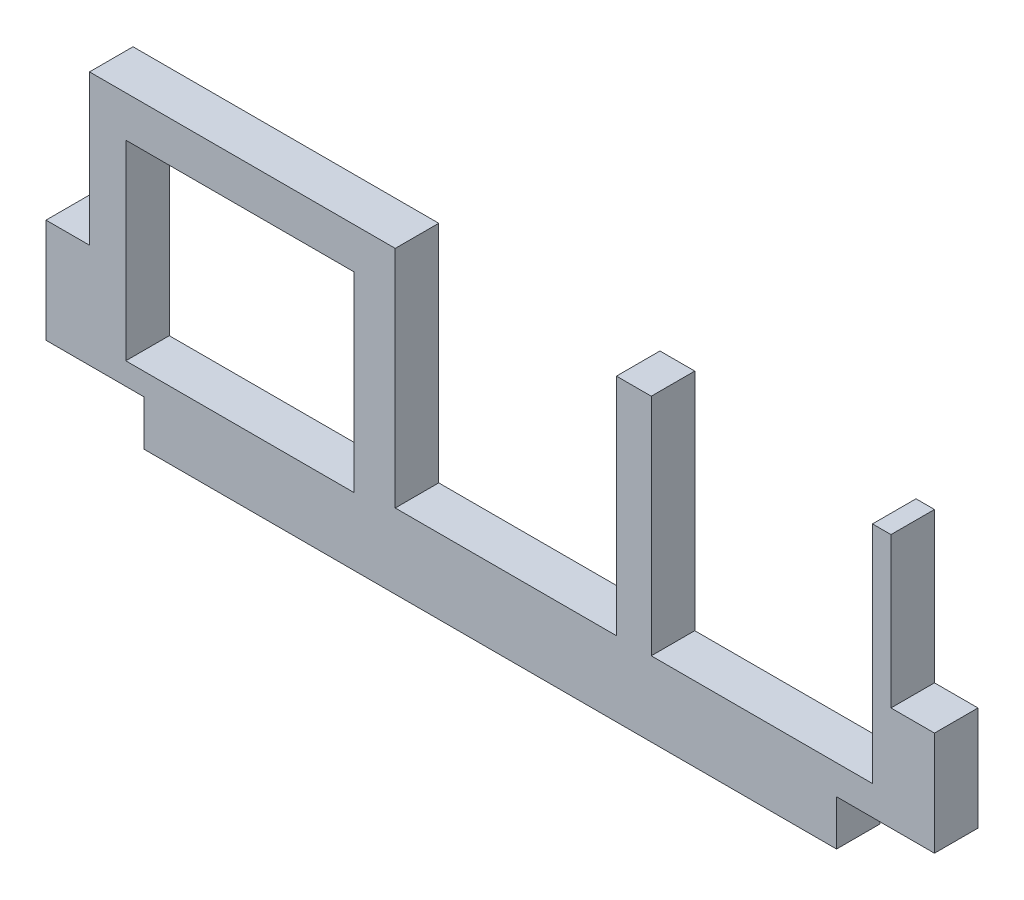
ISO-10303-21;
HEADER;
FILE_DESCRIPTION(('STEP AP214'),'2;1');
FILE_NAME('part.step','',(''),(''),'','','');
FILE_SCHEMA(('AUTOMOTIVE_DESIGN { 1 0 10303 214 1 1 1 1 }'));
ENDSEC;
DATA;
#1=APPLICATION_CONTEXT('core data for automotive mechanical design processes');
#2=APPLICATION_PROTOCOL_DEFINITION('international standard','automotive_design',2000,#1);
#3=PRODUCT_CONTEXT('',#1,'mechanical');
#4=PRODUCT('Part','Part','',(#3));
#5=PRODUCT_RELATED_PRODUCT_CATEGORY('part','',(#4));
#6=PRODUCT_DEFINITION_FORMATION('','',#4);
#7=PRODUCT_DEFINITION_CONTEXT('part definition',#1,'design');
#8=PRODUCT_DEFINITION('design','',#6,#7);
#9=PRODUCT_DEFINITION_SHAPE('','',#8);
#10=(LENGTH_UNIT() NAMED_UNIT(*) SI_UNIT(.MILLI.,.METRE.));
#11=(NAMED_UNIT(*) PLANE_ANGLE_UNIT() SI_UNIT($,.RADIAN.));
#12=(NAMED_UNIT(*) SI_UNIT($,.STERADIAN.) SOLID_ANGLE_UNIT());
#13=UNCERTAINTY_MEASURE_WITH_UNIT(LENGTH_MEASURE(1.E-05),#10,'distance_accuracy_value','');
#14=(GEOMETRIC_REPRESENTATION_CONTEXT(3) GLOBAL_UNCERTAINTY_ASSIGNED_CONTEXT((#13)) GLOBAL_UNIT_ASSIGNED_CONTEXT((#10,
#11,#12)) REPRESENTATION_CONTEXT('',''));
#15=CARTESIAN_POINT('',(0.,0.,0.));
#16=DIRECTION('',(0.,0.,1.));
#17=DIRECTION('',(1.,0.,0.));
#18=AXIS2_PLACEMENT_3D('',#15,#16,#17);
#19=CARTESIAN_POINT('',(-3.048,12.0142,3.048));
#20=DIRECTION('',(1.,0.,0.));
#21=DIRECTION('',(0.,0.,-1.));
#22=AXIS2_PLACEMENT_3D('',#19,#20,#21);
#23=PLANE('',#22);
#24=DIRECTION('',(0.,-1.,0.));
#25=VECTOR('',#24,1.);
#26=CARTESIAN_POINT('',(-3.048,12.0142,0.));
#27=LINE('',#26,#25);
#28=CARTESIAN_POINT('',(-3.048,12.0142,0.));
#29=VERTEX_POINT('',#28);
#30=CARTESIAN_POINT('',(-3.048,4.72440000000001,0.));
#31=VERTEX_POINT('',#30);
#32=EDGE_CURVE('E230',#29,#31,#27,.T.);
#33=ORIENTED_EDGE('',*,*,#32,.T.);
#34=DIRECTION('',(0.,0.,-1.));
#35=VECTOR('',#34,1.);
#36=CARTESIAN_POINT('',(-3.048,4.72440000000001,3.048));
#37=LINE('',#36,#35);
#38=CARTESIAN_POINT('',(-3.048,4.72440000000001,3.048));
#39=VERTEX_POINT('',#38);
#40=EDGE_CURVE('E11',#39,#31,#37,.T.);
#41=ORIENTED_EDGE('',*,*,#40,.F.);
#42=DIRECTION('',(0.,-1.,0.));
#43=VECTOR('',#42,1.);
#44=CARTESIAN_POINT('',(-3.048,12.0142,3.048));
#45=LINE('',#44,#43);
#46=CARTESIAN_POINT('',(-3.048,12.0142,3.048));
#47=VERTEX_POINT('',#46);
#48=EDGE_CURVE('E232',#47,#39,#45,.T.);
#49=ORIENTED_EDGE('',*,*,#48,.F.);
#50=DIRECTION('',(0.,0.,-1.));
#51=VECTOR('',#50,1.);
#52=CARTESIAN_POINT('',(-3.048,12.0142,3.048));
#53=LINE('',#52,#51);
#54=EDGE_CURVE('E272',#47,#29,#53,.T.);
#55=ORIENTED_EDGE('',*,*,#54,.T.);
#56=EDGE_LOOP('',(#33,#41,#49,#55));
#57=FACE_BOUND('',#56,.T.);
#58=ADVANCED_FACE('F33',(#57),#23,.F.);
#59=CARTESIAN_POINT('',(-3.048,4.72440000000001,3.048));
#60=DIRECTION('',(0.,1.,0.));
#61=DIRECTION('',(0.,0.,1.));
#62=AXIS2_PLACEMENT_3D('',#59,#60,#61);
#63=PLANE('',#62);
#64=DIRECTION('',(1.,0.,0.));
#65=VECTOR('',#64,1.);
#66=CARTESIAN_POINT('',(-3.048,4.72440000000001,0.));
#67=LINE('',#66,#65);
#68=CARTESIAN_POINT('',(3.81,4.72440000000001,0.));
#69=VERTEX_POINT('',#68);
#70=EDGE_CURVE('E275',#31,#69,#67,.T.);
#71=ORIENTED_EDGE('',*,*,#70,.T.);
#72=DIRECTION('',(0.,0.,-1.));
#73=VECTOR('',#72,1.);
#74=CARTESIAN_POINT('',(3.81,4.72440000000001,3.048));
#75=LINE('',#74,#73);
#76=CARTESIAN_POINT('',(3.81,4.72440000000001,3.048));
#77=VERTEX_POINT('',#76);
#78=EDGE_CURVE('E40',#77,#69,#75,.T.);
#79=ORIENTED_EDGE('',*,*,#78,.F.);
#80=DIRECTION('',(1.,0.,0.));
#81=VECTOR('',#80,1.);
#82=CARTESIAN_POINT('',(-3.048,4.72440000000001,3.048));
#83=LINE('',#82,#81);
#84=EDGE_CURVE('E139',#39,#77,#83,.T.);
#85=ORIENTED_EDGE('',*,*,#84,.F.);
#86=ORIENTED_EDGE('',*,*,#40,.T.);
#87=EDGE_LOOP('',(#71,#79,#85,#86));
#88=FACE_BOUND('',#87,.T.);
#89=ADVANCED_FACE('F393',(#88),#63,.F.);
#90=CARTESIAN_POINT('',(3.81,1.54940000000001,3.048));
#91=DIRECTION('',(1.,0.,0.));
#92=DIRECTION('',(0.,0.,-1.));
#93=AXIS2_PLACEMENT_3D('',#90,#91,#92);
#94=PLANE('',#93);
#95=DIRECTION('',(0.,-1.,0.));
#96=VECTOR('',#95,1.);
#97=CARTESIAN_POINT('',(3.81,1.54940000000001,0.));
#98=LINE('',#97,#96);
#99=CARTESIAN_POINT('',(3.81,1.54940000000001,0.));
#100=VERTEX_POINT('',#99);
#101=EDGE_CURVE('E277',#69,#100,#98,.T.);
#102=ORIENTED_EDGE('',*,*,#101,.T.);
#103=DIRECTION('',(0.,0.,-1.));
#104=VECTOR('',#103,1.);
#105=CARTESIAN_POINT('',(3.81,1.54940000000001,3.048));
#106=LINE('',#105,#104);
#107=CARTESIAN_POINT('',(3.81,1.54940000000001,3.048));
#108=VERTEX_POINT('',#107);
#109=EDGE_CURVE('E366',#108,#100,#106,.T.);
#110=ORIENTED_EDGE('',*,*,#109,.F.);
#111=DIRECTION('',(0.,-1.,0.));
#112=VECTOR('',#111,1.);
#113=CARTESIAN_POINT('',(3.81,1.54940000000001,3.048));
#114=LINE('',#113,#112);
#115=EDGE_CURVE('E235',#77,#108,#114,.T.);
#116=ORIENTED_EDGE('',*,*,#115,.F.);
#117=ORIENTED_EDGE('',*,*,#78,.T.);
#118=EDGE_LOOP('',(#102,#110,#116,#117));
#119=FACE_BOUND('',#118,.T.);
#120=ADVANCED_FACE('F372',(#119),#94,.F.);
#121=CARTESIAN_POINT('',(3.81,1.54940000000001,3.048));
#122=DIRECTION('',(0.,1.,0.));
#123=DIRECTION('',(0.,0.,1.));
#124=AXIS2_PLACEMENT_3D('',#121,#122,#123);
#125=PLANE('',#124);
#126=DIRECTION('',(1.,0.,0.));
#127=VECTOR('',#126,1.);
#128=CARTESIAN_POINT('',(3.81,1.54940000000001,0.));
#129=LINE('',#128,#127);
#130=CARTESIAN_POINT('',(52.324,1.54940000000001,0.));
#131=VERTEX_POINT('',#130);
#132=EDGE_CURVE('E279',#100,#131,#129,.T.);
#133=ORIENTED_EDGE('',*,*,#132,.T.);
#134=DIRECTION('',(0.,0.,-1.));
#135=VECTOR('',#134,1.);
#136=CARTESIAN_POINT('',(52.324,1.54940000000001,3.048));
#137=LINE('',#136,#135);
#138=CARTESIAN_POINT('',(52.324,1.54940000000001,3.048));
#139=VERTEX_POINT('',#138);
#140=EDGE_CURVE('E363',#139,#131,#137,.T.);
#141=ORIENTED_EDGE('',*,*,#140,.F.);
#142=DIRECTION('',(1.,0.,0.));
#143=VECTOR('',#142,1.);
#144=CARTESIAN_POINT('',(3.81,1.54940000000001,3.048));
#145=LINE('',#144,#143);
#146=EDGE_CURVE('E237',#108,#139,#145,.T.);
#147=ORIENTED_EDGE('',*,*,#146,.F.);
#148=ORIENTED_EDGE('',*,*,#109,.T.);
#149=EDGE_LOOP('',(#133,#141,#147,#148));
#150=FACE_BOUND('',#149,.T.);
#151=ADVANCED_FACE('F382',(#150),#125,.F.);
#152=CARTESIAN_POINT('',(52.324,1.54940000000001,3.048));
#153=DIRECTION('',(-1.,0.,0.));
#154=DIRECTION('',(0.,0.,1.));
#155=AXIS2_PLACEMENT_3D('',#152,#153,#154);
#156=PLANE('',#155);
#157=DIRECTION('',(0.,1.,0.));
#158=VECTOR('',#157,1.);
#159=CARTESIAN_POINT('',(52.324,1.54940000000001,0.));
#160=LINE('',#159,#158);
#161=CARTESIAN_POINT('',(52.324,4.72440000000001,0.));
#162=VERTEX_POINT('',#161);
#163=EDGE_CURVE('E281',#131,#162,#160,.T.);
#164=ORIENTED_EDGE('',*,*,#163,.T.);
#165=DIRECTION('',(0.,0.,-1.));
#166=VECTOR('',#165,1.);
#167=CARTESIAN_POINT('',(52.324,4.72440000000001,3.048));
#168=LINE('',#167,#166);
#169=CARTESIAN_POINT('',(52.324,4.72440000000001,3.048));
#170=VERTEX_POINT('',#169);
#171=EDGE_CURVE('E360',#170,#162,#168,.T.);
#172=ORIENTED_EDGE('',*,*,#171,.F.);
#173=DIRECTION('',(0.,1.,0.));
#174=VECTOR('',#173,1.);
#175=CARTESIAN_POINT('',(52.324,1.54940000000001,3.048));
#176=LINE('',#175,#174);
#177=EDGE_CURVE('E239',#139,#170,#176,.T.);
#178=ORIENTED_EDGE('',*,*,#177,.F.);
#179=ORIENTED_EDGE('',*,*,#140,.T.);
#180=EDGE_LOOP('',(#164,#172,#178,#179));
#181=FACE_BOUND('',#180,.T.);
#182=ADVANCED_FACE('F386',(#181),#156,.F.);
#183=CARTESIAN_POINT('',(52.324,4.72440000000001,3.048));
#184=DIRECTION('',(0.,1.,0.));
#185=DIRECTION('',(0.,0.,1.));
#186=AXIS2_PLACEMENT_3D('',#183,#184,#185);
#187=PLANE('',#186);
#188=DIRECTION('',(1.,0.,0.));
#189=VECTOR('',#188,1.);
#190=CARTESIAN_POINT('',(52.324,4.72440000000001,0.));
#191=LINE('',#190,#189);
#192=CARTESIAN_POINT('',(59.182,4.72440000000001,0.));
#193=VERTEX_POINT('',#192);
#194=EDGE_CURVE('E283',#162,#193,#191,.T.);
#195=ORIENTED_EDGE('',*,*,#194,.T.);
#196=DIRECTION('',(0.,0.,-1.));
#197=VECTOR('',#196,1.);
#198=CARTESIAN_POINT('',(59.182,4.72440000000001,3.048));
#199=LINE('',#198,#197);
#200=CARTESIAN_POINT('',(59.182,4.72440000000001,3.048));
#201=VERTEX_POINT('',#200);
#202=EDGE_CURVE('E357',#201,#193,#199,.T.);
#203=ORIENTED_EDGE('',*,*,#202,.F.);
#204=DIRECTION('',(1.,0.,0.));
#205=VECTOR('',#204,1.);
#206=CARTESIAN_POINT('',(52.324,4.72440000000001,3.048));
#207=LINE('',#206,#205);
#208=EDGE_CURVE('E241',#170,#201,#207,.T.);
#209=ORIENTED_EDGE('',*,*,#208,.F.);
#210=ORIENTED_EDGE('',*,*,#171,.T.);
#211=EDGE_LOOP('',(#195,#203,#209,#210));
#212=FACE_BOUND('',#211,.T.);
#213=ADVANCED_FACE('F405',(#212),#187,.F.);
#214=CARTESIAN_POINT('',(59.182,4.72440000000001,3.048));
#215=DIRECTION('',(-1.,0.,0.));
#216=DIRECTION('',(0.,0.,1.));
#217=AXIS2_PLACEMENT_3D('',#214,#215,#216);
#218=PLANE('',#217);
#219=DIRECTION('',(0.,1.,0.));
#220=VECTOR('',#219,1.);
#221=CARTESIAN_POINT('',(59.182,4.72440000000001,0.));
#222=LINE('',#221,#220);
#223=CARTESIAN_POINT('',(59.182,12.0142,0.));
#224=VERTEX_POINT('',#223);
#225=EDGE_CURVE('E285',#193,#224,#222,.T.);
#226=ORIENTED_EDGE('',*,*,#225,.T.);
#227=DIRECTION('',(0.,0.,-1.));
#228=VECTOR('',#227,1.);
#229=CARTESIAN_POINT('',(59.182,12.0142,3.048));
#230=LINE('',#229,#228);
#231=CARTESIAN_POINT('',(59.182,12.0142,3.048));
#232=VERTEX_POINT('',#231);
#233=EDGE_CURVE('E354',#232,#224,#230,.T.);
#234=ORIENTED_EDGE('',*,*,#233,.F.);
#235=DIRECTION('',(0.,1.,0.));
#236=VECTOR('',#235,1.);
#237=CARTESIAN_POINT('',(59.182,4.72440000000001,3.048));
#238=LINE('',#237,#236);
#239=EDGE_CURVE('E243',#201,#232,#238,.T.);
#240=ORIENTED_EDGE('',*,*,#239,.F.);
#241=ORIENTED_EDGE('',*,*,#202,.T.);
#242=EDGE_LOOP('',(#226,#234,#240,#241));
#243=FACE_BOUND('',#242,.T.);
#244=ADVANCED_FACE('F408',(#243),#218,.F.);
#245=CARTESIAN_POINT('',(59.182,12.0142,3.048));
#246=DIRECTION('',(0.,-1.,0.));
#247=DIRECTION('',(0.,0.,-1.));
#248=AXIS2_PLACEMENT_3D('',#245,#246,#247);
#249=PLANE('',#248);
#250=DIRECTION('',(-1.,0.,0.));
#251=VECTOR('',#250,1.);
#252=CARTESIAN_POINT('',(59.182,12.0142,0.));
#253=LINE('',#252,#251);
#254=CARTESIAN_POINT('',(56.134,12.0142,0.));
#255=VERTEX_POINT('',#254);
#256=EDGE_CURVE('E287',#224,#255,#253,.T.);
#257=ORIENTED_EDGE('',*,*,#256,.T.);
#258=DIRECTION('',(0.,0.,-1.));
#259=VECTOR('',#258,1.);
#260=CARTESIAN_POINT('',(56.134,12.0142,3.048));
#261=LINE('',#260,#259);
#262=CARTESIAN_POINT('',(56.134,12.0142,3.048));
#263=VERTEX_POINT('',#262);
#264=EDGE_CURVE('E351',#263,#255,#261,.T.);
#265=ORIENTED_EDGE('',*,*,#264,.F.);
#266=DIRECTION('',(-1.,0.,0.));
#267=VECTOR('',#266,1.);
#268=CARTESIAN_POINT('',(59.182,12.0142,3.048));
#269=LINE('',#268,#267);
#270=EDGE_CURVE('E245',#232,#263,#269,.T.);
#271=ORIENTED_EDGE('',*,*,#270,.F.);
#272=ORIENTED_EDGE('',*,*,#233,.T.);
#273=EDGE_LOOP('',(#257,#265,#271,#272));
#274=FACE_BOUND('',#273,.T.);
#275=ADVANCED_FACE('F412',(#274),#249,.F.);
#276=CARTESIAN_POINT('',(56.134,22.5298,3.048));
#277=DIRECTION('',(-1.,0.,0.));
#278=DIRECTION('',(0.,0.,1.));
#279=AXIS2_PLACEMENT_3D('',#276,#277,#278);
#280=PLANE('',#279);
#281=DIRECTION('',(0.,1.,0.));
#282=VECTOR('',#281,1.);
#283=CARTESIAN_POINT('',(56.134,22.5298,0.));
#284=LINE('',#283,#282);
#285=CARTESIAN_POINT('',(56.134,22.5298,0.));
#286=VERTEX_POINT('',#285);
#287=EDGE_CURVE('E289',#255,#286,#284,.T.);
#288=ORIENTED_EDGE('',*,*,#287,.T.);
#289=DIRECTION('',(0.,0.,-1.));
#290=VECTOR('',#289,1.);
#291=CARTESIAN_POINT('',(56.134,22.5298,3.048));
#292=LINE('',#291,#290);
#293=CARTESIAN_POINT('',(56.134,22.5298,3.048));
#294=VERTEX_POINT('',#293);
#295=EDGE_CURVE('E348',#294,#286,#292,.T.);
#296=ORIENTED_EDGE('',*,*,#295,.F.);
#297=DIRECTION('',(0.,1.,0.));
#298=VECTOR('',#297,1.);
#299=CARTESIAN_POINT('',(56.134,22.5298,3.048));
#300=LINE('',#299,#298);
#301=EDGE_CURVE('E247',#263,#294,#300,.T.);
#302=ORIENTED_EDGE('',*,*,#301,.F.);
#303=ORIENTED_EDGE('',*,*,#264,.T.);
#304=EDGE_LOOP('',(#288,#296,#302,#303));
#305=FACE_BOUND('',#304,.T.);
#306=ADVANCED_FACE('F416',(#305),#280,.F.);
#307=CARTESIAN_POINT('',(54.8386,22.5298,3.048));
#308=DIRECTION('',(0.,-1.,0.));
#309=DIRECTION('',(0.,0.,-1.));
#310=AXIS2_PLACEMENT_3D('',#307,#308,#309);
#311=PLANE('',#310);
#312=DIRECTION('',(-1.,0.,0.));
#313=VECTOR('',#312,1.);
#314=CARTESIAN_POINT('',(54.8386,22.5298,0.));
#315=LINE('',#314,#313);
#316=CARTESIAN_POINT('',(54.8386,22.5298,0.));
#317=VERTEX_POINT('',#316);
#318=EDGE_CURVE('E291',#286,#317,#315,.T.);
#319=ORIENTED_EDGE('',*,*,#318,.T.);
#320=DIRECTION('',(0.,0.,-1.));
#321=VECTOR('',#320,1.);
#322=CARTESIAN_POINT('',(54.8386,22.5298,3.048));
#323=LINE('',#322,#321);
#324=CARTESIAN_POINT('',(54.8386,22.5298,3.048));
#325=VERTEX_POINT('',#324);
#326=EDGE_CURVE('E345',#325,#317,#323,.T.);
#327=ORIENTED_EDGE('',*,*,#326,.F.);
#328=DIRECTION('',(-1.,0.,0.));
#329=VECTOR('',#328,1.);
#330=CARTESIAN_POINT('',(54.8386,22.5298,3.048));
#331=LINE('',#330,#329);
#332=EDGE_CURVE('E249',#294,#325,#331,.T.);
#333=ORIENTED_EDGE('',*,*,#332,.F.);
#334=ORIENTED_EDGE('',*,*,#295,.T.);
#335=EDGE_LOOP('',(#319,#327,#333,#334));
#336=FACE_BOUND('',#335,.T.);
#337=ADVANCED_FACE('F420',(#336),#311,.F.);
#338=CARTESIAN_POINT('',(54.8386,6.78180000000001,3.048));
#339=DIRECTION('',(1.,0.,0.));
#340=DIRECTION('',(0.,0.,-1.));
#341=AXIS2_PLACEMENT_3D('',#338,#339,#340);
#342=PLANE('',#341);
#343=DIRECTION('',(0.,-1.,0.));
#344=VECTOR('',#343,1.);
#345=CARTESIAN_POINT('',(54.8386,6.78180000000001,0.));
#346=LINE('',#345,#344);
#347=CARTESIAN_POINT('',(54.8386,6.78180000000001,0.));
#348=VERTEX_POINT('',#347);
#349=EDGE_CURVE('E293',#317,#348,#346,.T.);
#350=ORIENTED_EDGE('',*,*,#349,.T.);
#351=DIRECTION('',(0.,0.,-1.));
#352=VECTOR('',#351,1.);
#353=CARTESIAN_POINT('',(54.8386,6.78180000000001,3.048));
#354=LINE('',#353,#352);
#355=CARTESIAN_POINT('',(54.8386,6.78180000000001,3.048));
#356=VERTEX_POINT('',#355);
#357=EDGE_CURVE('E342',#356,#348,#354,.T.);
#358=ORIENTED_EDGE('',*,*,#357,.F.);
#359=DIRECTION('',(0.,-1.,0.));
#360=VECTOR('',#359,1.);
#361=CARTESIAN_POINT('',(54.8386,6.78180000000001,3.048));
#362=LINE('',#361,#360);
#363=EDGE_CURVE('E251',#325,#356,#362,.T.);
#364=ORIENTED_EDGE('',*,*,#363,.F.);
#365=ORIENTED_EDGE('',*,*,#326,.T.);
#366=EDGE_LOOP('',(#350,#358,#364,#365));
#367=FACE_BOUND('',#366,.T.);
#368=ADVANCED_FACE('F424',(#367),#342,.F.);
#369=CARTESIAN_POINT('',(39.3446,6.78180000000001,3.048));
#370=DIRECTION('',(0.,-1.,0.));
#371=DIRECTION('',(0.,0.,-1.));
#372=AXIS2_PLACEMENT_3D('',#369,#370,#371);
#373=PLANE('',#372);
#374=DIRECTION('',(-1.,0.,0.));
#375=VECTOR('',#374,1.);
#376=CARTESIAN_POINT('',(39.3446,6.78180000000001,0.));
#377=LINE('',#376,#375);
#378=CARTESIAN_POINT('',(39.3446,6.78180000000001,0.));
#379=VERTEX_POINT('',#378);
#380=EDGE_CURVE('E295',#348,#379,#377,.T.);
#381=ORIENTED_EDGE('',*,*,#380,.T.);
#382=DIRECTION('',(0.,0.,-1.));
#383=VECTOR('',#382,1.);
#384=CARTESIAN_POINT('',(39.3446,6.78180000000001,3.048));
#385=LINE('',#384,#383);
#386=CARTESIAN_POINT('',(39.3446,6.78180000000001,3.048));
#387=VERTEX_POINT('',#386);
#388=EDGE_CURVE('E339',#387,#379,#385,.T.);
#389=ORIENTED_EDGE('',*,*,#388,.F.);
#390=DIRECTION('',(-1.,0.,0.));
#391=VECTOR('',#390,1.);
#392=CARTESIAN_POINT('',(39.3446,6.78180000000001,3.048));
#393=LINE('',#392,#391);
#394=EDGE_CURVE('E253',#356,#387,#393,.T.);
#395=ORIENTED_EDGE('',*,*,#394,.F.);
#396=ORIENTED_EDGE('',*,*,#357,.T.);
#397=EDGE_LOOP('',(#381,#389,#395,#396));
#398=FACE_BOUND('',#397,.T.);
#399=ADVANCED_FACE('F428',(#398),#373,.F.);
#400=CARTESIAN_POINT('',(39.3446,22.5298,3.048));
#401=DIRECTION('',(-1.,0.,0.));
#402=DIRECTION('',(0.,0.,1.));
#403=AXIS2_PLACEMENT_3D('',#400,#401,#402);
#404=PLANE('',#403);
#405=DIRECTION('',(0.,1.,0.));
#406=VECTOR('',#405,1.);
#407=CARTESIAN_POINT('',(39.3446,22.5298,0.));
#408=LINE('',#407,#406);
#409=CARTESIAN_POINT('',(39.3446,22.5298,0.));
#410=VERTEX_POINT('',#409);
#411=EDGE_CURVE('E297',#379,#410,#408,.T.);
#412=ORIENTED_EDGE('',*,*,#411,.T.);
#413=DIRECTION('',(0.,0.,-1.));
#414=VECTOR('',#413,1.);
#415=CARTESIAN_POINT('',(39.3446,22.5298,3.048));
#416=LINE('',#415,#414);
#417=CARTESIAN_POINT('',(39.3446,22.5298,3.048));
#418=VERTEX_POINT('',#417);
#419=EDGE_CURVE('E336',#418,#410,#416,.T.);
#420=ORIENTED_EDGE('',*,*,#419,.F.);
#421=DIRECTION('',(0.,1.,0.));
#422=VECTOR('',#421,1.);
#423=CARTESIAN_POINT('',(39.3446,22.5298,3.048));
#424=LINE('',#423,#422);
#425=EDGE_CURVE('E255',#387,#418,#424,.T.);
#426=ORIENTED_EDGE('',*,*,#425,.F.);
#427=ORIENTED_EDGE('',*,*,#388,.T.);
#428=EDGE_LOOP('',(#412,#420,#426,#427));
#429=FACE_BOUND('',#428,.T.);
#430=ADVANCED_FACE('F432',(#429),#404,.F.);
#431=CARTESIAN_POINT('',(36.9062,22.5298,3.048));
#432=DIRECTION('',(0.,-1.,0.));
#433=DIRECTION('',(0.,0.,-1.));
#434=AXIS2_PLACEMENT_3D('',#431,#432,#433);
#435=PLANE('',#434);
#436=DIRECTION('',(-1.,0.,0.));
#437=VECTOR('',#436,1.);
#438=CARTESIAN_POINT('',(36.9062,22.5298,0.));
#439=LINE('',#438,#437);
#440=CARTESIAN_POINT('',(36.9062,22.5298,0.));
#441=VERTEX_POINT('',#440);
#442=EDGE_CURVE('E299',#410,#441,#439,.T.);
#443=ORIENTED_EDGE('',*,*,#442,.T.);
#444=DIRECTION('',(0.,0.,-1.));
#445=VECTOR('',#444,1.);
#446=CARTESIAN_POINT('',(36.9062,22.5298,3.048));
#447=LINE('',#446,#445);
#448=CARTESIAN_POINT('',(36.9062,22.5298,3.048));
#449=VERTEX_POINT('',#448);
#450=EDGE_CURVE('E333',#449,#441,#447,.T.);
#451=ORIENTED_EDGE('',*,*,#450,.F.);
#452=DIRECTION('',(-1.,0.,0.));
#453=VECTOR('',#452,1.);
#454=CARTESIAN_POINT('',(36.9062,22.5298,3.048));
#455=LINE('',#454,#453);
#456=EDGE_CURVE('E257',#418,#449,#455,.T.);
#457=ORIENTED_EDGE('',*,*,#456,.F.);
#458=ORIENTED_EDGE('',*,*,#419,.T.);
#459=EDGE_LOOP('',(#443,#451,#457,#458));
#460=FACE_BOUND('',#459,.T.);
#461=ADVANCED_FACE('F436',(#460),#435,.F.);
#462=CARTESIAN_POINT('',(36.9062,6.78180000000001,3.048));
#463=DIRECTION('',(1.,0.,0.));
#464=DIRECTION('',(0.,0.,-1.));
#465=AXIS2_PLACEMENT_3D('',#462,#463,#464);
#466=PLANE('',#465);
#467=DIRECTION('',(0.,-1.,0.));
#468=VECTOR('',#467,1.);
#469=CARTESIAN_POINT('',(36.9062,6.78180000000001,0.));
#470=LINE('',#469,#468);
#471=CARTESIAN_POINT('',(36.9062,6.78180000000001,0.));
#472=VERTEX_POINT('',#471);
#473=EDGE_CURVE('E301',#441,#472,#470,.T.);
#474=ORIENTED_EDGE('',*,*,#473,.T.);
#475=DIRECTION('',(0.,0.,-1.));
#476=VECTOR('',#475,1.);
#477=CARTESIAN_POINT('',(36.9062,6.78180000000001,3.048));
#478=LINE('',#477,#476);
#479=CARTESIAN_POINT('',(36.9062,6.78180000000001,3.048));
#480=VERTEX_POINT('',#479);
#481=EDGE_CURVE('E330',#480,#472,#478,.T.);
#482=ORIENTED_EDGE('',*,*,#481,.F.);
#483=DIRECTION('',(0.,-1.,0.));
#484=VECTOR('',#483,1.);
#485=CARTESIAN_POINT('',(36.9062,6.78180000000001,3.048));
#486=LINE('',#485,#484);
#487=EDGE_CURVE('E259',#449,#480,#486,.T.);
#488=ORIENTED_EDGE('',*,*,#487,.F.);
#489=ORIENTED_EDGE('',*,*,#450,.T.);
#490=EDGE_LOOP('',(#474,#482,#488,#489));
#491=FACE_BOUND('',#490,.T.);
#492=ADVANCED_FACE('F440',(#491),#466,.F.);
#493=CARTESIAN_POINT('',(21.4122,6.78180000000001,3.048));
#494=DIRECTION('',(0.,-1.,0.));
#495=DIRECTION('',(0.,0.,-1.));
#496=AXIS2_PLACEMENT_3D('',#493,#494,#495);
#497=PLANE('',#496);
#498=DIRECTION('',(-1.,0.,0.));
#499=VECTOR('',#498,1.);
#500=CARTESIAN_POINT('',(21.4122,6.78180000000001,0.));
#501=LINE('',#500,#499);
#502=CARTESIAN_POINT('',(21.4122,6.78180000000001,0.));
#503=VERTEX_POINT('',#502);
#504=EDGE_CURVE('E303',#472,#503,#501,.T.);
#505=ORIENTED_EDGE('',*,*,#504,.T.);
#506=DIRECTION('',(0.,0.,-1.));
#507=VECTOR('',#506,1.);
#508=CARTESIAN_POINT('',(21.4122,6.78180000000001,3.048));
#509=LINE('',#508,#507);
#510=CARTESIAN_POINT('',(21.4122,6.78180000000001,3.048));
#511=VERTEX_POINT('',#510);
#512=EDGE_CURVE('E327',#511,#503,#509,.T.);
#513=ORIENTED_EDGE('',*,*,#512,.F.);
#514=DIRECTION('',(-1.,0.,0.));
#515=VECTOR('',#514,1.);
#516=CARTESIAN_POINT('',(21.4122,6.78180000000001,3.048));
#517=LINE('',#516,#515);
#518=EDGE_CURVE('E261',#480,#511,#517,.T.);
#519=ORIENTED_EDGE('',*,*,#518,.F.);
#520=ORIENTED_EDGE('',*,*,#481,.T.);
#521=EDGE_LOOP('',(#505,#513,#519,#520));
#522=FACE_BOUND('',#521,.T.);
#523=ADVANCED_FACE('F444',(#522),#497,.F.);
#524=CARTESIAN_POINT('',(21.4122,22.5298,3.048));
#525=DIRECTION('',(-1.,0.,0.));
#526=DIRECTION('',(0.,-1.,0.));
#527=AXIS2_PLACEMENT_3D('',#524,#525,#526);
#528=PLANE('',#527);
#529=DIRECTION('',(0.,1.,0.));
#530=VECTOR('',#529,1.);
#531=CARTESIAN_POINT('',(21.4122,22.5298,0.));
#532=LINE('',#531,#530);
#533=CARTESIAN_POINT('',(21.4122,22.5298,0.));
#534=VERTEX_POINT('',#533);
#535=EDGE_CURVE('E305',#503,#534,#532,.T.);
#536=ORIENTED_EDGE('',*,*,#535,.T.);
#537=DIRECTION('',(0.,0.,-1.));
#538=VECTOR('',#537,1.);
#539=CARTESIAN_POINT('',(21.4122,22.5298,3.048));
#540=LINE('',#539,#538);
#541=CARTESIAN_POINT('',(21.4122,22.5298,3.048));
#542=VERTEX_POINT('',#541);
#543=EDGE_CURVE('E324',#542,#534,#540,.T.);
#544=ORIENTED_EDGE('',*,*,#543,.F.);
#545=DIRECTION('',(0.,1.,0.));
#546=VECTOR('',#545,1.);
#547=CARTESIAN_POINT('',(21.4122,22.5298,3.048));
#548=LINE('',#547,#546);
#549=EDGE_CURVE('E263',#511,#542,#548,.T.);
#550=ORIENTED_EDGE('',*,*,#549,.F.);
#551=ORIENTED_EDGE('',*,*,#512,.T.);
#552=EDGE_LOOP('',(#536,#544,#550,#551));
#553=FACE_BOUND('',#552,.T.);
#554=ADVANCED_FACE('F448',(#553),#528,.F.);
#555=CARTESIAN_POINT('',(18.542,22.5298,3.048));
#556=DIRECTION('',(0.,-1.,0.));
#557=DIRECTION('',(0.,0.,-1.));
#558=AXIS2_PLACEMENT_3D('',#555,#556,#557);
#559=PLANE('',#558);
#560=DIRECTION('',(-1.,0.,0.));
#561=VECTOR('',#560,1.);
#562=CARTESIAN_POINT('',(18.542,22.5298,0.));
#563=LINE('',#562,#561);
#564=CARTESIAN_POINT('',(0.,22.5298,0.));
#565=VERTEX_POINT('',#564);
#566=EDGE_CURVE('E307',#534,#565,#563,.T.);
#567=ORIENTED_EDGE('',*,*,#566,.T.);
#568=DIRECTION('',(0.,0.,1.));
#569=VECTOR('',#568,1.);
#570=CARTESIAN_POINT('',(0.,22.5298,0.));
#571=LINE('',#570,#569);
#572=CARTESIAN_POINT('',(0.,22.5298,3.048));
#573=VERTEX_POINT('',#572);
#574=EDGE_CURVE('E227',#565,#573,#571,.T.);
#575=ORIENTED_EDGE('',*,*,#574,.T.);
#576=DIRECTION('',(-1.,0.,0.));
#577=VECTOR('',#576,1.);
#578=CARTESIAN_POINT('',(18.542,22.5298,3.048));
#579=LINE('',#578,#577);
#580=EDGE_CURVE('E265',#542,#573,#579,.T.);
#581=ORIENTED_EDGE('',*,*,#580,.F.);
#582=ORIENTED_EDGE('',*,*,#543,.T.);
#583=EDGE_LOOP('',(#567,#575,#581,#582));
#584=FACE_BOUND('',#583,.T.);
#585=ADVANCED_FACE('F452',(#584),#559,.F.);
#586=CARTESIAN_POINT('',(18.542,6.27380000000001,3.048));
#587=DIRECTION('',(1.,0.,0.));
#588=DIRECTION('',(0.,0.,-1.));
#589=AXIS2_PLACEMENT_3D('',#586,#587,#588);
#590=PLANE('',#589);
#591=DIRECTION('',(0.,-1.,0.));
#592=VECTOR('',#591,1.);
#593=CARTESIAN_POINT('',(18.542,6.27380000000001,3.048));
#594=LINE('',#593,#592);
#595=CARTESIAN_POINT('',(18.542,19.6596,3.048));
#596=VERTEX_POINT('',#595);
#597=CARTESIAN_POINT('',(18.542,6.27380000000001,3.048));
#598=VERTEX_POINT('',#597);
#599=EDGE_CURVE('E47',#596,#598,#594,.T.);
#600=ORIENTED_EDGE('',*,*,#599,.F.);
#601=DIRECTION('',(0.,0.,1.));
#602=VECTOR('',#601,1.);
#603=CARTESIAN_POINT('',(18.542,19.6596,0.));
#604=LINE('',#603,#602);
#605=CARTESIAN_POINT('',(18.542,19.6596,0.));
#606=VERTEX_POINT('',#605);
#607=EDGE_CURVE('E222',#606,#596,#604,.T.);
#608=ORIENTED_EDGE('',*,*,#607,.F.);
#609=DIRECTION('',(0.,-1.,0.));
#610=VECTOR('',#609,1.);
#611=CARTESIAN_POINT('',(18.542,6.27380000000001,0.));
#612=LINE('',#611,#610);
#613=CARTESIAN_POINT('',(18.542,6.27380000000001,0.));
#614=VERTEX_POINT('',#613);
#615=EDGE_CURVE('E310',#606,#614,#612,.T.);
#616=ORIENTED_EDGE('',*,*,#615,.T.);
#617=DIRECTION('',(0.,0.,-1.));
#618=VECTOR('',#617,1.);
#619=CARTESIAN_POINT('',(18.542,6.27380000000001,3.048));
#620=LINE('',#619,#618);
#621=EDGE_CURVE('E321',#598,#614,#620,.T.);
#622=ORIENTED_EDGE('',*,*,#621,.F.);
#623=EDGE_LOOP('',(#600,#608,#616,#622));
#624=FACE_BOUND('',#623,.T.);
#625=ADVANCED_FACE('F456',(#624),#590,.F.);
#626=CARTESIAN_POINT('',(2.54,6.27380000000001,3.048));
#627=DIRECTION('',(0.,-1.,0.));
#628=DIRECTION('',(0.,0.,-1.));
#629=AXIS2_PLACEMENT_3D('',#626,#627,#628);
#630=PLANE('',#629);
#631=DIRECTION('',(-1.,0.,0.));
#632=VECTOR('',#631,1.);
#633=CARTESIAN_POINT('',(2.54,6.27380000000001,0.));
#634=LINE('',#633,#632);
#635=CARTESIAN_POINT('',(2.54,6.27380000000001,0.));
#636=VERTEX_POINT('',#635);
#637=EDGE_CURVE('E312',#614,#636,#634,.T.);
#638=ORIENTED_EDGE('',*,*,#637,.T.);
#639=DIRECTION('',(0.,0.,-1.));
#640=VECTOR('',#639,1.);
#641=CARTESIAN_POINT('',(2.54,6.27380000000001,3.048));
#642=LINE('',#641,#640);
#643=CARTESIAN_POINT('',(2.54,6.27380000000001,3.048));
#644=VERTEX_POINT('',#643);
#645=EDGE_CURVE('E218',#644,#636,#642,.T.);
#646=ORIENTED_EDGE('',*,*,#645,.F.);
#647=DIRECTION('',(-1.,0.,0.));
#648=VECTOR('',#647,1.);
#649=CARTESIAN_POINT('',(2.54,6.27380000000001,3.048));
#650=LINE('',#649,#648);
#651=EDGE_CURVE('E204',#598,#644,#650,.T.);
#652=ORIENTED_EDGE('',*,*,#651,.F.);
#653=ORIENTED_EDGE('',*,*,#621,.T.);
#654=EDGE_LOOP('',(#638,#646,#652,#653));
#655=FACE_BOUND('',#654,.T.);
#656=ADVANCED_FACE('F460',(#655),#630,.F.);
#657=CARTESIAN_POINT('',(2.54,19.6596,3.048));
#658=DIRECTION('',(-1.,0.,0.));
#659=DIRECTION('',(0.,-1.,0.));
#660=AXIS2_PLACEMENT_3D('',#657,#658,#659);
#661=PLANE('',#660);
#662=DIRECTION('',(0.,1.,0.));
#663=VECTOR('',#662,1.);
#664=CARTESIAN_POINT('',(2.54,19.6596,0.));
#665=LINE('',#664,#663);
#666=CARTESIAN_POINT('',(2.54,19.6596,0.));
#667=VERTEX_POINT('',#666);
#668=EDGE_CURVE('E214',#636,#667,#665,.T.);
#669=ORIENTED_EDGE('',*,*,#668,.T.);
#670=DIRECTION('',(0.,0.,-1.));
#671=VECTOR('',#670,1.);
#672=CARTESIAN_POINT('',(2.54,19.6596,3.048));
#673=LINE('',#672,#671);
#674=CARTESIAN_POINT('',(2.54,19.6596,3.048));
#675=VERTEX_POINT('',#674);
#676=EDGE_CURVE('E211',#675,#667,#673,.T.);
#677=ORIENTED_EDGE('',*,*,#676,.F.);
#678=DIRECTION('',(0.,1.,0.));
#679=VECTOR('',#678,1.);
#680=CARTESIAN_POINT('',(2.54,19.6596,3.048));
#681=LINE('',#680,#679);
#682=EDGE_CURVE('E197',#644,#675,#681,.T.);
#683=ORIENTED_EDGE('',*,*,#682,.F.);
#684=ORIENTED_EDGE('',*,*,#645,.T.);
#685=EDGE_LOOP('',(#669,#677,#683,#684));
#686=FACE_BOUND('',#685,.T.);
#687=ADVANCED_FACE('F212',(#686),#661,.F.);
#688=CARTESIAN_POINT('',(0.,12.0142,3.048));
#689=DIRECTION('',(1.,0.,0.));
#690=DIRECTION('',(0.,0.,-1.));
#691=AXIS2_PLACEMENT_3D('',#688,#689,#690);
#692=PLANE('',#691);
#693=DIRECTION('',(0.,-1.,0.));
#694=VECTOR('',#693,1.);
#695=CARTESIAN_POINT('',(0.,12.0142,0.));
#696=LINE('',#695,#694);
#697=CARTESIAN_POINT('',(0.,12.0142,0.));
#698=VERTEX_POINT('',#697);
#699=EDGE_CURVE('E315',#565,#698,#696,.T.);
#700=ORIENTED_EDGE('',*,*,#699,.T.);
#701=DIRECTION('',(0.,0.,-1.));
#702=VECTOR('',#701,1.);
#703=CARTESIAN_POINT('',(0.,12.0142,3.048));
#704=LINE('',#703,#702);
#705=CARTESIAN_POINT('',(0.,12.0142,3.048));
#706=VERTEX_POINT('',#705);
#707=EDGE_CURVE('E219',#706,#698,#704,.T.);
#708=ORIENTED_EDGE('',*,*,#707,.F.);
#709=DIRECTION('',(0.,-1.,0.));
#710=VECTOR('',#709,1.);
#711=CARTESIAN_POINT('',(0.,12.0142,3.048));
#712=LINE('',#711,#710);
#713=EDGE_CURVE('E208',#573,#706,#712,.T.);
#714=ORIENTED_EDGE('',*,*,#713,.F.);
#715=ORIENTED_EDGE('',*,*,#574,.F.);
#716=EDGE_LOOP('',(#700,#708,#714,#715));
#717=FACE_BOUND('',#716,.T.);
#718=ADVANCED_FACE('F466',(#717),#692,.F.);
#719=CARTESIAN_POINT('',(-3.048,12.0142,3.048));
#720=DIRECTION('',(0.,-1.,0.));
#721=DIRECTION('',(0.,0.,-1.));
#722=AXIS2_PLACEMENT_3D('',#719,#720,#721);
#723=PLANE('',#722);
#724=DIRECTION('',(-1.,0.,0.));
#725=VECTOR('',#724,1.);
#726=CARTESIAN_POINT('',(-3.048,12.0142,0.));
#727=LINE('',#726,#725);
#728=EDGE_CURVE('E131',#698,#29,#727,.T.);
#729=ORIENTED_EDGE('',*,*,#728,.T.);
#730=ORIENTED_EDGE('',*,*,#54,.F.);
#731=DIRECTION('',(-1.,0.,0.));
#732=VECTOR('',#731,1.);
#733=CARTESIAN_POINT('',(-3.048,12.0142,3.048));
#734=LINE('',#733,#732);
#735=EDGE_CURVE('E56',#706,#47,#734,.T.);
#736=ORIENTED_EDGE('',*,*,#735,.F.);
#737=ORIENTED_EDGE('',*,*,#707,.T.);
#738=EDGE_LOOP('',(#729,#730,#736,#737));
#739=FACE_BOUND('',#738,.T.);
#740=ADVANCED_FACE('F469',(#739),#723,.F.);
#741=CARTESIAN_POINT('',(0.,0.,3.048));
#742=DIRECTION('',(0.,0.,1.));
#743=DIRECTION('',(1.,0.,0.));
#744=AXIS2_PLACEMENT_3D('',#741,#742,#743);
#745=PLANE('',#744);
#746=DIRECTION('',(1.,0.,0.));
#747=VECTOR('',#746,1.);
#748=CARTESIAN_POINT('',(0.,19.6596,3.048));
#749=LINE('',#748,#747);
#750=EDGE_CURVE('E201',#675,#596,#749,.T.);
#751=ORIENTED_EDGE('',*,*,#750,.T.);
#752=ORIENTED_EDGE('',*,*,#599,.T.);
#753=ORIENTED_EDGE('',*,*,#651,.T.);
#754=ORIENTED_EDGE('',*,*,#682,.T.);
#755=EDGE_LOOP('',(#751,#752,#753,#754));
#756=FACE_BOUND('',#755,.T.);
#757=ORIENTED_EDGE('',*,*,#48,.T.);
#758=ORIENTED_EDGE('',*,*,#84,.T.);
#759=ORIENTED_EDGE('',*,*,#115,.T.);
#760=ORIENTED_EDGE('',*,*,#146,.T.);
#761=ORIENTED_EDGE('',*,*,#177,.T.);
#762=ORIENTED_EDGE('',*,*,#208,.T.);
#763=ORIENTED_EDGE('',*,*,#239,.T.);
#764=ORIENTED_EDGE('',*,*,#270,.T.);
#765=ORIENTED_EDGE('',*,*,#301,.T.);
#766=ORIENTED_EDGE('',*,*,#332,.T.);
#767=ORIENTED_EDGE('',*,*,#363,.T.);
#768=ORIENTED_EDGE('',*,*,#394,.T.);
#769=ORIENTED_EDGE('',*,*,#425,.T.);
#770=ORIENTED_EDGE('',*,*,#456,.T.);
#771=ORIENTED_EDGE('',*,*,#487,.T.);
#772=ORIENTED_EDGE('',*,*,#518,.T.);
#773=ORIENTED_EDGE('',*,*,#549,.T.);
#774=ORIENTED_EDGE('',*,*,#580,.T.);
#775=ORIENTED_EDGE('',*,*,#713,.T.);
#776=ORIENTED_EDGE('',*,*,#735,.T.);
#777=EDGE_LOOP('',(#757,#758,#759,#760,#761,#762,#763,#764,#765,#766,#767,#768,#769,#770,#771,
#772,#773,#774,#775,#776));
#778=FACE_BOUND('',#777,.T.);
#779=ADVANCED_FACE('F199',(#756,#778),#745,.T.);
#780=CARTESIAN_POINT('',(0.,0.,0.));
#781=DIRECTION('',(0.,0.,1.));
#782=DIRECTION('',(1.,0.,0.));
#783=AXIS2_PLACEMENT_3D('',#780,#781,#782);
#784=PLANE('',#783);
#785=ORIENTED_EDGE('',*,*,#615,.F.);
#786=DIRECTION('',(1.,0.,0.));
#787=VECTOR('',#786,1.);
#788=CARTESIAN_POINT('',(0.,19.6596,0.));
#789=LINE('',#788,#787);
#790=EDGE_CURVE('E223',#667,#606,#789,.T.);
#791=ORIENTED_EDGE('',*,*,#790,.F.);
#792=ORIENTED_EDGE('',*,*,#668,.F.);
#793=ORIENTED_EDGE('',*,*,#637,.F.);
#794=EDGE_LOOP('',(#785,#791,#792,#793));
#795=FACE_BOUND('',#794,.T.);
#796=ORIENTED_EDGE('',*,*,#32,.F.);
#797=ORIENTED_EDGE('',*,*,#728,.F.);
#798=ORIENTED_EDGE('',*,*,#699,.F.);
#799=ORIENTED_EDGE('',*,*,#566,.F.);
#800=ORIENTED_EDGE('',*,*,#535,.F.);
#801=ORIENTED_EDGE('',*,*,#504,.F.);
#802=ORIENTED_EDGE('',*,*,#473,.F.);
#803=ORIENTED_EDGE('',*,*,#442,.F.);
#804=ORIENTED_EDGE('',*,*,#411,.F.);
#805=ORIENTED_EDGE('',*,*,#380,.F.);
#806=ORIENTED_EDGE('',*,*,#349,.F.);
#807=ORIENTED_EDGE('',*,*,#318,.F.);
#808=ORIENTED_EDGE('',*,*,#287,.F.);
#809=ORIENTED_EDGE('',*,*,#256,.F.);
#810=ORIENTED_EDGE('',*,*,#225,.F.);
#811=ORIENTED_EDGE('',*,*,#194,.F.);
#812=ORIENTED_EDGE('',*,*,#163,.F.);
#813=ORIENTED_EDGE('',*,*,#132,.F.);
#814=ORIENTED_EDGE('',*,*,#101,.F.);
#815=ORIENTED_EDGE('',*,*,#70,.F.);
#816=EDGE_LOOP('',(#796,#797,#798,#799,#800,#801,#802,#803,#804,#805,#806,#807,#808,#809,#810,
#811,#812,#813,#814,#815));
#817=FACE_BOUND('',#816,.T.);
#818=ADVANCED_FACE('F377',(#795,#817),#784,.F.);
#819=CARTESIAN_POINT('',(0.,19.6596,0.));
#820=DIRECTION('',(0.,-1.,0.));
#821=DIRECTION('',(0.,0.,-1.));
#822=AXIS2_PLACEMENT_3D('',#819,#820,#821);
#823=PLANE('',#822);
#824=ORIENTED_EDGE('',*,*,#676,.T.);
#825=ORIENTED_EDGE('',*,*,#790,.T.);
#826=ORIENTED_EDGE('',*,*,#607,.T.);
#827=ORIENTED_EDGE('',*,*,#750,.F.);
#828=EDGE_LOOP('',(#824,#825,#826,#827));
#829=FACE_BOUND('',#828,.T.);
#830=ADVANCED_FACE('F221',(#829),#823,.T.);
#831=CLOSED_SHELL('',(#58,#89,#120,#151,#182,#213,#244,#275,#306,#337,#368,#399,#430,#461,#492,
#523,#554,#585,#625,#656,#687,#718,#740,#779,#818,#830));
#832=MANIFOLD_SOLID_BREP('B2',#831);
#833=ADVANCED_BREP_SHAPE_REPRESENTATION('',(#18,#832),#14);
#834=SHAPE_DEFINITION_REPRESENTATION(#9,#833);
ENDSEC;
END-ISO-10303-21;
